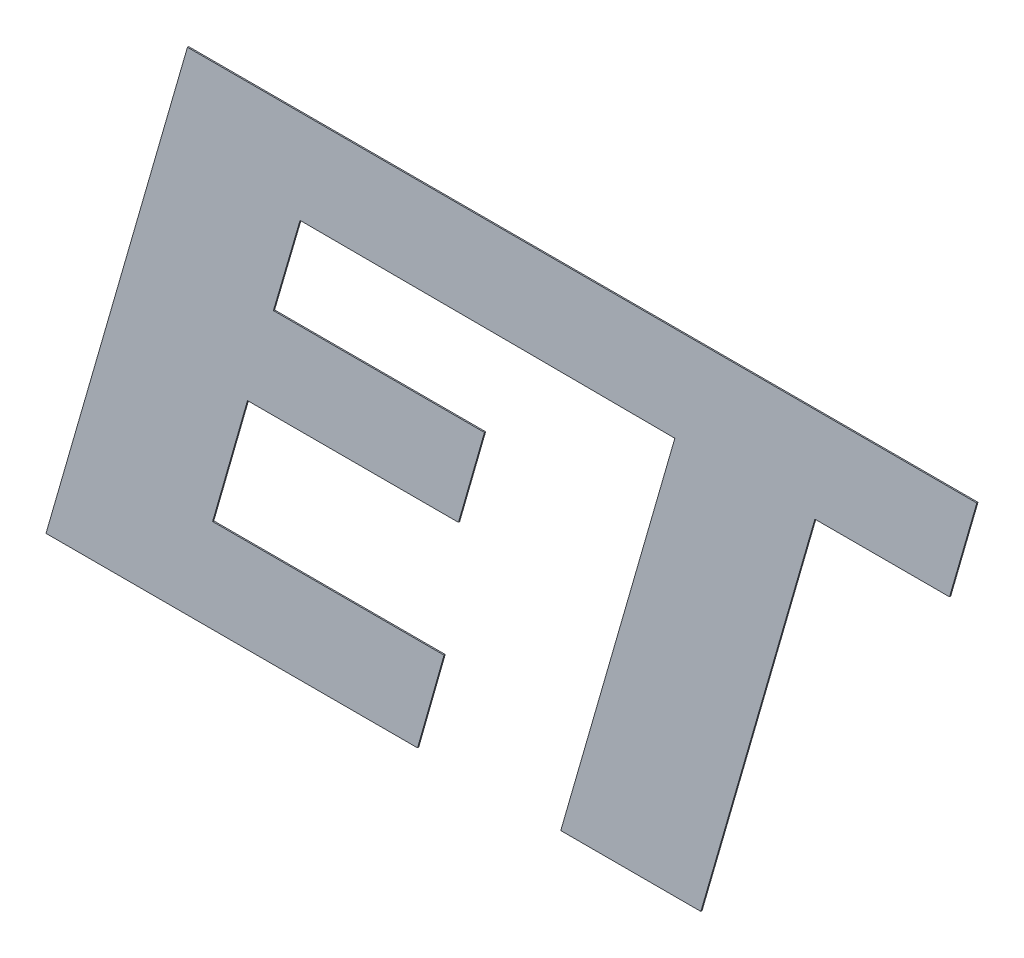
ISO-10303-21;
HEADER;
FILE_DESCRIPTION(('STEP AP214'),'2;1');
FILE_NAME('part.step','',(''),(''),'','','');
FILE_SCHEMA(('AUTOMOTIVE_DESIGN { 1 0 10303 214 1 1 1 1 }'));
ENDSEC;
DATA;
#1=APPLICATION_CONTEXT('core data for automotive mechanical design processes');
#2=APPLICATION_PROTOCOL_DEFINITION('international standard','automotive_design',2000,#1);
#3=PRODUCT_CONTEXT('',#1,'mechanical');
#4=PRODUCT('Part','Part','',(#3));
#5=PRODUCT_RELATED_PRODUCT_CATEGORY('part','',(#4));
#6=PRODUCT_DEFINITION_FORMATION('','',#4);
#7=PRODUCT_DEFINITION_CONTEXT('part definition',#1,'design');
#8=PRODUCT_DEFINITION('design','',#6,#7);
#9=PRODUCT_DEFINITION_SHAPE('','',#8);
#10=(LENGTH_UNIT() NAMED_UNIT(*) SI_UNIT(.MILLI.,.METRE.));
#11=(NAMED_UNIT(*) PLANE_ANGLE_UNIT() SI_UNIT($,.RADIAN.));
#12=(NAMED_UNIT(*) SI_UNIT($,.STERADIAN.) SOLID_ANGLE_UNIT());
#13=UNCERTAINTY_MEASURE_WITH_UNIT(LENGTH_MEASURE(1.E-05),#10,'distance_accuracy_value','');
#14=(GEOMETRIC_REPRESENTATION_CONTEXT(3) GLOBAL_UNCERTAINTY_ASSIGNED_CONTEXT((#13)) GLOBAL_UNIT_ASSIGNED_CONTEXT((#10,
#11,#12)) REPRESENTATION_CONTEXT('',''));
#15=CARTESIAN_POINT('',(0.,0.,0.));
#16=DIRECTION('',(0.,0.,1.));
#17=DIRECTION('',(1.,0.,0.));
#18=AXIS2_PLACEMENT_3D('',#15,#16,#17);
#19=CARTESIAN_POINT('',(11.563212908811,6.43585562533324,5.205));
#20=DIRECTION('',(0.00281330167602132,0.99999604265901,0.));
#21=DIRECTION('',(0.,0.,-1.));
#22=AXIS2_PLACEMENT_3D('',#19,#20,#21);
#23=PLANE('',#22);
#24=DIRECTION('',(0.99999604265901,-0.00281330167602132,0.));
#25=VECTOR('',#24,1.);
#26=CARTESIAN_POINT('',(11.563212908811,6.43585562533324,5.2));
#27=LINE('',#26,#25);
#28=CARTESIAN_POINT('',(11.563212908811,6.43585562533324,5.2));
#29=VERTEX_POINT('',#28);
#30=CARTESIAN_POINT('',(12.5025242320755,6.43321304875561,5.2));
#31=VERTEX_POINT('',#30);
#32=EDGE_CURVE('E10',#29,#31,#27,.T.);
#33=ORIENTED_EDGE('',*,*,#32,.T.);
#34=DIRECTION('',(0.,0.,-1.));
#35=VECTOR('',#34,1.);
#36=CARTESIAN_POINT('',(12.5025242320755,6.43321304875561,5.205));
#37=LINE('',#36,#35);
#38=CARTESIAN_POINT('',(12.5025242320755,6.43321304875561,5.205));
#39=VERTEX_POINT('',#38);
#40=EDGE_CURVE('E42',#39,#31,#37,.T.);
#41=ORIENTED_EDGE('',*,*,#40,.F.);
#42=DIRECTION('',(0.99999604265901,-0.00281330167602132,0.));
#43=VECTOR('',#42,1.);
#44=CARTESIAN_POINT('',(11.563212908811,6.43585562533324,5.205));
#45=LINE('',#44,#43);
#46=CARTESIAN_POINT('',(11.563212908811,6.43585562533324,5.205));
#47=VERTEX_POINT('',#46);
#48=EDGE_CURVE('E250',#47,#39,#45,.T.);
#49=ORIENTED_EDGE('',*,*,#48,.F.);
#50=DIRECTION('',(0.,0.,-1.));
#51=VECTOR('',#50,1.);
#52=CARTESIAN_POINT('',(11.563212908811,6.43585562533324,5.205));
#53=LINE('',#52,#51);
#54=EDGE_CURVE('E27',#47,#29,#53,.T.);
#55=ORIENTED_EDGE('',*,*,#54,.T.);
#56=EDGE_LOOP('',(#33,#41,#49,#55));
#57=FACE_BOUND('',#56,.T.);
#58=ADVANCED_FACE('F16',(#57),#23,.F.);
#59=CARTESIAN_POINT('',(12.5025242320755,6.43321304875561,5.205));
#60=DIRECTION('',(0.00465069382367867,0.999989185465002,0.));
#61=DIRECTION('',(0.,0.,-1.));
#62=AXIS2_PLACEMENT_3D('',#59,#60,#61);
#63=PLANE('',#62);
#64=DIRECTION('',(0.999989185465002,-0.00465069382367867,0.));
#65=VECTOR('',#64,1.);
#66=CARTESIAN_POINT('',(12.5025242320755,6.43321304875561,5.2));
#67=LINE('',#66,#65);
#68=CARTESIAN_POINT('',(13.1256737048785,6.43031494000952,5.2));
#69=VERTEX_POINT('',#68);
#70=EDGE_CURVE('E228',#31,#69,#67,.T.);
#71=ORIENTED_EDGE('',*,*,#70,.T.);
#72=DIRECTION('',(0.,0.,-1.));
#73=VECTOR('',#72,1.);
#74=CARTESIAN_POINT('',(13.1256737048785,6.43031494000952,5.205));
#75=LINE('',#74,#73);
#76=CARTESIAN_POINT('',(13.1256737048785,6.43031494000952,5.205));
#77=VERTEX_POINT('',#76);
#78=EDGE_CURVE('E419',#77,#69,#75,.T.);
#79=ORIENTED_EDGE('',*,*,#78,.F.);
#80=DIRECTION('',(0.999989185465002,-0.00465069382367867,0.));
#81=VECTOR('',#80,1.);
#82=CARTESIAN_POINT('',(12.5025242320755,6.43321304875561,5.205));
#83=LINE('',#82,#81);
#84=EDGE_CURVE('E220',#39,#77,#83,.T.);
#85=ORIENTED_EDGE('',*,*,#84,.F.);
#86=ORIENTED_EDGE('',*,*,#40,.T.);
#87=EDGE_LOOP('',(#71,#79,#85,#86));
#88=FACE_BOUND('',#87,.T.);
#89=ADVANCED_FACE('F453',(#88),#63,.F.);
#90=CARTESIAN_POINT('',(13.1256737048785,6.43031494000952,5.205));
#91=DIRECTION('',(0.961066454899901,-0.276317334356962,0.));
#92=DIRECTION('',(0.,0.,-1.));
#93=AXIS2_PLACEMENT_3D('',#90,#91,#92);
#94=PLANE('',#93);
#95=DIRECTION('',(-0.276317334356962,-0.961066454899901,0.));
#96=VECTOR('',#95,1.);
#97=CARTESIAN_POINT('',(13.1256737048785,6.43031494000952,5.2));
#98=LINE('',#97,#96);
#99=CARTESIAN_POINT('',(12.6501345708676,4.77632999999994,5.2));
#100=VERTEX_POINT('',#99);
#101=EDGE_CURVE('E247',#69,#100,#98,.T.);
#102=ORIENTED_EDGE('',*,*,#101,.T.);
#103=DIRECTION('',(0.,0.,-1.));
#104=VECTOR('',#103,1.);
#105=CARTESIAN_POINT('',(12.6501345708676,4.77632999999994,5.205));
#106=LINE('',#105,#104);
#107=CARTESIAN_POINT('',(12.6501345708676,4.77632999999994,5.205));
#108=VERTEX_POINT('',#107);
#109=EDGE_CURVE('E235',#108,#100,#106,.T.);
#110=ORIENTED_EDGE('',*,*,#109,.F.);
#111=DIRECTION('',(-0.276317334356962,-0.961066454899901,0.));
#112=VECTOR('',#111,1.);
#113=CARTESIAN_POINT('',(13.1256737048785,6.43031494000952,5.205));
#114=LINE('',#113,#112);
#115=EDGE_CURVE('E218',#77,#108,#114,.T.);
#116=ORIENTED_EDGE('',*,*,#115,.F.);
#117=ORIENTED_EDGE('',*,*,#78,.T.);
#118=EDGE_LOOP('',(#102,#110,#116,#117));
#119=FACE_BOUND('',#118,.T.);
#120=ADVANCED_FACE('F458',(#119),#94,.F.);
#121=CARTESIAN_POINT('',(12.6501345708676,4.77632999999994,5.205));
#122=DIRECTION('',(0.,1.,0.));
#123=DIRECTION('',(1.,0.,0.));
#124=AXIS2_PLACEMENT_3D('',#121,#122,#123);
#125=PLANE('',#124);
#126=DIRECTION('',(1.,0.,0.));
#127=VECTOR('',#126,1.);
#128=CARTESIAN_POINT('',(12.6501345708676,4.77632999999994,5.2));
#129=LINE('',#128,#127);
#130=CARTESIAN_POINT('',(13.2340318095169,4.77632999999994,5.2));
#131=VERTEX_POINT('',#130);
#132=EDGE_CURVE('E174',#100,#131,#129,.T.);
#133=ORIENTED_EDGE('',*,*,#132,.T.);
#134=DIRECTION('',(0.,0.,-1.));
#135=VECTOR('',#134,1.);
#136=CARTESIAN_POINT('',(13.2340318095169,4.77632999999994,5.205));
#137=LINE('',#136,#135);
#138=CARTESIAN_POINT('',(13.2340318095169,4.77632999999994,5.205));
#139=VERTEX_POINT('',#138);
#140=EDGE_CURVE('E208',#139,#131,#137,.T.);
#141=ORIENTED_EDGE('',*,*,#140,.F.);
#142=DIRECTION('',(1.,0.,0.));
#143=VECTOR('',#142,1.);
#144=CARTESIAN_POINT('',(12.6501345708676,4.77632999999994,5.205));
#145=LINE('',#144,#143);
#146=EDGE_CURVE('E144',#108,#139,#145,.T.);
#147=ORIENTED_EDGE('',*,*,#146,.F.);
#148=ORIENTED_EDGE('',*,*,#109,.T.);
#149=EDGE_LOOP('',(#133,#141,#147,#148));
#150=FACE_BOUND('',#149,.T.);
#151=ADVANCED_FACE('F436',(#150),#125,.F.);
#152=CARTESIAN_POINT('',(13.2340318095169,4.77632999999994,5.205));
#153=DIRECTION('',(-0.961087610217285,0.276243742891722,0.));
#154=DIRECTION('',(0.,0.,1.));
#155=AXIS2_PLACEMENT_3D('',#152,#153,#154);
#156=PLANE('',#155);
#157=DIRECTION('',(0.276243742891722,0.961087610217285,0.));
#158=VECTOR('',#157,1.);
#159=CARTESIAN_POINT('',(13.2340318095169,4.77632999999994,5.2));
#160=LINE('',#159,#158);
#161=CARTESIAN_POINT('',(13.7094338287044,6.43031494000443,5.2));
#162=VERTEX_POINT('',#161);
#163=EDGE_CURVE('E153',#131,#162,#160,.T.);
#164=ORIENTED_EDGE('',*,*,#163,.T.);
#165=DIRECTION('',(0.,0.,-1.));
#166=VECTOR('',#165,1.);
#167=CARTESIAN_POINT('',(13.7094338287044,6.43031494000443,5.205));
#168=LINE('',#167,#166);
#169=CARTESIAN_POINT('',(13.7094338287044,6.43031494000443,5.205));
#170=VERTEX_POINT('',#169);
#171=EDGE_CURVE('E150',#170,#162,#168,.T.);
#172=ORIENTED_EDGE('',*,*,#171,.F.);
#173=DIRECTION('',(0.276243742891722,0.961087610217285,0.));
#174=VECTOR('',#173,1.);
#175=CARTESIAN_POINT('',(13.2340318095169,4.77632999999994,5.205));
#176=LINE('',#175,#174);
#177=EDGE_CURVE('E137',#139,#170,#176,.T.);
#178=ORIENTED_EDGE('',*,*,#177,.F.);
#179=ORIENTED_EDGE('',*,*,#140,.T.);
#180=EDGE_LOOP('',(#164,#172,#178,#179));
#181=FACE_BOUND('',#180,.T.);
#182=ADVANCED_FACE('F151',(#181),#156,.F.);
#183=CARTESIAN_POINT('',(13.7094338287044,6.43031494000443,5.205));
#184=DIRECTION('',(7.938847109814E-05,0.999999996848735,0.));
#185=DIRECTION('',(0.,0.,-1.));
#186=AXIS2_PLACEMENT_3D('',#183,#184,#185);
#187=PLANE('',#186);
#188=DIRECTION('',(0.999999996848735,-7.93884710981399E-05,0.));
#189=VECTOR('',#188,1.);
#190=CARTESIAN_POINT('',(13.7094338287044,6.43031494000443,5.2));
#191=LINE('',#190,#189);
#192=CARTESIAN_POINT('',(14.2706376699915,6.43027038688935,5.2));
#193=VERTEX_POINT('',#192);
#194=EDGE_CURVE('E158',#162,#193,#191,.T.);
#195=ORIENTED_EDGE('',*,*,#194,.T.);
#196=DIRECTION('',(0.,0.,-1.));
#197=VECTOR('',#196,1.);
#198=CARTESIAN_POINT('',(14.2706376699915,6.43027038688935,5.205));
#199=LINE('',#198,#197);
#200=CARTESIAN_POINT('',(14.2706376699915,6.43027038688935,5.205));
#201=VERTEX_POINT('',#200);
#202=EDGE_CURVE('E162',#201,#193,#199,.T.);
#203=ORIENTED_EDGE('',*,*,#202,.F.);
#204=DIRECTION('',(0.999999996848735,-7.93884710981399E-05,0.));
#205=VECTOR('',#204,1.);
#206=CARTESIAN_POINT('',(13.7094338287044,6.43031494000443,5.205));
#207=LINE('',#206,#205);
#208=EDGE_CURVE('E141',#170,#201,#207,.T.);
#209=ORIENTED_EDGE('',*,*,#208,.F.);
#210=ORIENTED_EDGE('',*,*,#171,.T.);
#211=EDGE_LOOP('',(#195,#203,#209,#210));
#212=FACE_BOUND('',#211,.T.);
#213=ADVANCED_FACE('F161',(#212),#187,.F.);
#214=CARTESIAN_POINT('',(14.2706376699915,6.43027038688935,5.205));
#215=DIRECTION('',(-0.961099233430489,0.276203301029018,0.));
#216=DIRECTION('',(0.,0.,1.));
#217=AXIS2_PLACEMENT_3D('',#214,#215,#216);
#218=PLANE('',#217);
#219=DIRECTION('',(0.276203301029018,0.961099233430489,0.));
#220=VECTOR('',#219,1.);
#221=CARTESIAN_POINT('',(14.2706376699915,6.43027038688935,5.2));
#222=LINE('',#221,#220);
#223=CARTESIAN_POINT('',(14.3843877760506,6.82608440985244,5.2));
#224=VERTEX_POINT('',#223);
#225=EDGE_CURVE('E159',#193,#224,#222,.T.);
#226=ORIENTED_EDGE('',*,*,#225,.T.);
#227=DIRECTION('',(0.,0.,-1.));
#228=VECTOR('',#227,1.);
#229=CARTESIAN_POINT('',(14.3843877760506,6.82608440985244,5.205));
#230=LINE('',#229,#228);
#231=CARTESIAN_POINT('',(14.3843877760506,6.82608440985244,5.205));
#232=VERTEX_POINT('',#231);
#233=EDGE_CURVE('E186',#232,#224,#230,.T.);
#234=ORIENTED_EDGE('',*,*,#233,.F.);
#235=DIRECTION('',(0.276203301029018,0.961099233430489,0.));
#236=VECTOR('',#235,1.);
#237=CARTESIAN_POINT('',(14.2706376699915,6.43027038688935,5.205));
#238=LINE('',#237,#236);
#239=EDGE_CURVE('E165',#201,#232,#238,.T.);
#240=ORIENTED_EDGE('',*,*,#239,.F.);
#241=ORIENTED_EDGE('',*,*,#202,.T.);
#242=EDGE_LOOP('',(#226,#234,#240,#241));
#243=FACE_BOUND('',#242,.T.);
#244=ADVANCED_FACE('F441',(#243),#218,.F.);
#245=CARTESIAN_POINT('',(12.6155317773363,6.82608440985244,5.205));
#246=DIRECTION('',(0.,-1.,0.));
#247=DIRECTION('',(0.,0.,-1.));
#248=AXIS2_PLACEMENT_3D('',#245,#246,#247);
#249=PLANE('',#248);
#250=DIRECTION('',(-1.,0.,0.));
#251=VECTOR('',#250,1.);
#252=CARTESIAN_POINT('',(12.6155317773363,6.82608440985244,5.2));
#253=LINE('',#252,#251);
#254=CARTESIAN_POINT('',(11.0938813384048,6.82608440985244,5.2));
#255=VERTEX_POINT('',#254);
#256=EDGE_CURVE('E270',#224,#255,#253,.T.);
#257=ORIENTED_EDGE('',*,*,#256,.T.);
#258=DIRECTION('',(0.,0.,-1.));
#259=VECTOR('',#258,1.);
#260=CARTESIAN_POINT('',(11.0938813384048,6.82608440985244,5.205));
#261=LINE('',#260,#259);
#262=CARTESIAN_POINT('',(11.0938813384048,6.82608440985244,5.205));
#263=VERTEX_POINT('',#262);
#264=EDGE_CURVE('E187',#263,#255,#261,.T.);
#265=ORIENTED_EDGE('',*,*,#264,.F.);
#266=DIRECTION('',(-1.,0.,0.));
#267=VECTOR('',#266,1.);
#268=CARTESIAN_POINT('',(14.3843877760506,6.82608440985244,5.205));
#269=LINE('',#268,#267);
#270=EDGE_CURVE('E171',#232,#263,#269,.T.);
#271=ORIENTED_EDGE('',*,*,#270,.F.);
#272=ORIENTED_EDGE('',*,*,#233,.T.);
#273=EDGE_LOOP('',(#257,#265,#271,#272));
#274=FACE_BOUND('',#273,.T.);
#275=ADVANCED_FACE('F383',(#274),#249,.F.);
#276=CARTESIAN_POINT('',(11.0938813384048,6.82608440985244,5.205));
#277=DIRECTION('',(0.961034823670664,-0.276427328048977,0.));
#278=DIRECTION('',(0.,0.,-1.));
#279=AXIS2_PLACEMENT_3D('',#276,#277,#278);
#280=PLANE('',#279);
#281=DIRECTION('',(-0.276427328048977,-0.961034823670664,0.));
#282=VECTOR('',#281,1.);
#283=CARTESIAN_POINT('',(11.0938813384048,6.82608440985244,5.2));
#284=LINE('',#283,#282);
#285=CARTESIAN_POINT('',(10.5043000654724,4.77632999999994,5.2));
#286=VERTEX_POINT('',#285);
#287=EDGE_CURVE('E182',#255,#286,#284,.T.);
#288=ORIENTED_EDGE('',*,*,#287,.T.);
#289=DIRECTION('',(0.,0.,-1.));
#290=VECTOR('',#289,1.);
#291=CARTESIAN_POINT('',(10.5043000654724,4.77632999999994,5.205));
#292=LINE('',#291,#290);
#293=CARTESIAN_POINT('',(10.5043000654724,4.77632999999994,5.205));
#294=VERTEX_POINT('',#293);
#295=EDGE_CURVE('E258',#294,#286,#292,.T.);
#296=ORIENTED_EDGE('',*,*,#295,.F.);
#297=DIRECTION('',(-0.276427328048977,-0.961034823670664,0.));
#298=VECTOR('',#297,1.);
#299=CARTESIAN_POINT('',(11.0938813384048,6.82608440985244,5.205));
#300=LINE('',#299,#298);
#301=EDGE_CURVE('E194',#263,#294,#300,.T.);
#302=ORIENTED_EDGE('',*,*,#301,.F.);
#303=ORIENTED_EDGE('',*,*,#264,.T.);
#304=EDGE_LOOP('',(#288,#296,#302,#303));
#305=FACE_BOUND('',#304,.T.);
#306=ADVANCED_FACE('F386',(#305),#280,.F.);
#307=CARTESIAN_POINT('',(10.5043000654724,4.77632999999994,5.205));
#308=DIRECTION('',(0.,1.,0.));
#309=DIRECTION('',(1.,0.,0.));
#310=AXIS2_PLACEMENT_3D('',#307,#308,#309);
#311=PLANE('',#310);
#312=DIRECTION('',(1.,0.,0.));
#313=VECTOR('',#312,1.);
#314=CARTESIAN_POINT('',(10.5043000654724,4.77632999999994,5.2));
#315=LINE('',#314,#313);
#316=CARTESIAN_POINT('',(12.0529496594305,4.77632999999994,5.2));
#317=VERTEX_POINT('',#316);
#318=EDGE_CURVE('E254',#286,#317,#315,.T.);
#319=ORIENTED_EDGE('',*,*,#318,.T.);
#320=DIRECTION('',(0.,0.,-1.));
#321=VECTOR('',#320,1.);
#322=CARTESIAN_POINT('',(12.0529496594305,4.77632999999994,5.205));
#323=LINE('',#322,#321);
#324=CARTESIAN_POINT('',(12.0529496594305,4.77632999999994,5.205));
#325=VERTEX_POINT('',#324);
#326=EDGE_CURVE('E180',#325,#317,#323,.T.);
#327=ORIENTED_EDGE('',*,*,#326,.F.);
#328=DIRECTION('',(1.,0.,0.));
#329=VECTOR('',#328,1.);
#330=CARTESIAN_POINT('',(10.5043000654724,4.77632999999994,5.205));
#331=LINE('',#330,#329);
#332=EDGE_CURVE('E197',#294,#325,#331,.T.);
#333=ORIENTED_EDGE('',*,*,#332,.F.);
#334=ORIENTED_EDGE('',*,*,#295,.T.);
#335=EDGE_LOOP('',(#319,#327,#333,#334));
#336=FACE_BOUND('',#335,.T.);
#337=ADVANCED_FACE('F391',(#336),#311,.F.);
#338=CARTESIAN_POINT('',(12.0529496594305,4.77632999999994,5.205));
#339=DIRECTION('',(-0.962020079379883,0.272978693069485,0.));
#340=DIRECTION('',(0.,0.,1.));
#341=AXIS2_PLACEMENT_3D('',#338,#339,#340);
#342=PLANE('',#341);
#343=DIRECTION('',(0.272978693069485,0.962020079379883,0.));
#344=VECTOR('',#343,1.);
#345=CARTESIAN_POINT('',(12.0529496594305,4.77632999999994,5.2));
#346=LINE('',#345,#344);
#347=CARTESIAN_POINT('',(12.1636262510655,5.16637180975795,5.2));
#348=VERTEX_POINT('',#347);
#349=EDGE_CURVE('E262',#317,#348,#346,.T.);
#350=ORIENTED_EDGE('',*,*,#349,.T.);
#351=DIRECTION('',(0.,0.,-1.));
#352=VECTOR('',#351,1.);
#353=CARTESIAN_POINT('',(12.1636262510655,5.16637180975795,5.205));
#354=LINE('',#353,#352);
#355=CARTESIAN_POINT('',(12.1636262510655,5.16637180975795,5.205));
#356=VERTEX_POINT('',#355);
#357=EDGE_CURVE('E181',#356,#348,#354,.T.);
#358=ORIENTED_EDGE('',*,*,#357,.F.);
#359=DIRECTION('',(0.272978693069485,0.962020079379883,0.));
#360=VECTOR('',#359,1.);
#361=CARTESIAN_POINT('',(12.0529496594305,4.77632999999994,5.205));
#362=LINE('',#361,#360);
#363=EDGE_CURVE('E20',#325,#356,#362,.T.);
#364=ORIENTED_EDGE('',*,*,#363,.F.);
#365=ORIENTED_EDGE('',*,*,#326,.T.);
#366=EDGE_LOOP('',(#350,#358,#364,#365));
#367=FACE_BOUND('',#366,.T.);
#368=ADVANCED_FACE('F399',(#367),#342,.F.);
#369=CARTESIAN_POINT('',(12.1636262510655,5.16637180975795,5.205));
#370=DIRECTION('',(0.,-1.,0.));
#371=DIRECTION('',(0.,0.,-1.));
#372=AXIS2_PLACEMENT_3D('',#369,#370,#371);
#373=PLANE('',#372);
#374=DIRECTION('',(-1.,0.,0.));
#375=VECTOR('',#374,1.);
#376=CARTESIAN_POINT('',(12.1636262510655,5.16637180975795,5.2));
#377=LINE('',#376,#375);
#378=CARTESIAN_POINT('',(11.1987492459184,5.16637180975795,5.2));
#379=VERTEX_POINT('',#378);
#380=EDGE_CURVE('E176',#348,#379,#377,.T.);
#381=ORIENTED_EDGE('',*,*,#380,.T.);
#382=DIRECTION('',(0.,0.,-1.));
#383=VECTOR('',#382,1.);
#384=CARTESIAN_POINT('',(11.1987492459184,5.16637180975795,5.205));
#385=LINE('',#384,#383);
#386=CARTESIAN_POINT('',(11.1987492459184,5.16637180975795,5.205));
#387=VERTEX_POINT('',#386);
#388=EDGE_CURVE('E198',#387,#379,#385,.T.);
#389=ORIENTED_EDGE('',*,*,#388,.F.);
#390=DIRECTION('',(-1.,0.,0.));
#391=VECTOR('',#390,1.);
#392=CARTESIAN_POINT('',(12.1636262510655,5.16637180975795,5.205));
#393=LINE('',#392,#391);
#394=EDGE_CURVE('E300',#356,#387,#393,.T.);
#395=ORIENTED_EDGE('',*,*,#394,.F.);
#396=ORIENTED_EDGE('',*,*,#357,.T.);
#397=EDGE_LOOP('',(#381,#389,#395,#396));
#398=FACE_BOUND('',#397,.T.);
#399=ADVANCED_FACE('F403',(#398),#373,.F.);
#400=CARTESIAN_POINT('',(11.1987492459184,5.16637180975795,5.205));
#401=DIRECTION('',(-0.961582531986915,0.274515999857263,0.));
#402=DIRECTION('',(0.,0.,1.));
#403=AXIS2_PLACEMENT_3D('',#400,#401,#402);
#404=PLANE('',#403);
#405=DIRECTION('',(0.274515999857263,0.961582531986915,0.));
#406=VECTOR('',#405,1.);
#407=CARTESIAN_POINT('',(11.1987492459184,5.16637180975795,5.2));
#408=LINE('',#407,#406);
#409=CARTESIAN_POINT('',(11.3441657475534,5.67574090994719,5.2));
#410=VERTEX_POINT('',#409);
#411=EDGE_CURVE('E201',#379,#410,#408,.T.);
#412=ORIENTED_EDGE('',*,*,#411,.T.);
#413=DIRECTION('',(0.,0.,-1.));
#414=VECTOR('',#413,1.);
#415=CARTESIAN_POINT('',(11.3441657475534,5.67574090994719,5.205));
#416=LINE('',#415,#414);
#417=CARTESIAN_POINT('',(11.3441657475534,5.67574090994719,5.205));
#418=VERTEX_POINT('',#417);
#419=EDGE_CURVE('E234',#418,#410,#416,.T.);
#420=ORIENTED_EDGE('',*,*,#419,.F.);
#421=DIRECTION('',(0.274515999857263,0.961582531986915,0.));
#422=VECTOR('',#421,1.);
#423=CARTESIAN_POINT('',(11.1987492459184,5.16637180975795,5.205));
#424=LINE('',#423,#422);
#425=EDGE_CURVE('E192',#387,#418,#424,.T.);
#426=ORIENTED_EDGE('',*,*,#425,.F.);
#427=ORIENTED_EDGE('',*,*,#388,.T.);
#428=EDGE_LOOP('',(#412,#420,#426,#427));
#429=FACE_BOUND('',#428,.T.);
#430=ADVANCED_FACE('F481',(#429),#404,.F.);
#431=CARTESIAN_POINT('',(11.3441657475534,5.67574090994719,5.205));
#432=DIRECTION('',(0.,1.,0.));
#433=DIRECTION('',(1.,0.,0.));
#434=AXIS2_PLACEMENT_3D('',#431,#432,#433);
#435=PLANE('',#434);
#436=DIRECTION('',(1.,0.,0.));
#437=VECTOR('',#436,1.);
#438=CARTESIAN_POINT('',(11.3441657475534,5.67574090994719,5.2));
#439=LINE('',#438,#437);
#440=CARTESIAN_POINT('',(12.2236825432721,5.67574090994719,5.2));
#441=VERTEX_POINT('',#440);
#442=EDGE_CURVE('E202',#410,#441,#439,.T.);
#443=ORIENTED_EDGE('',*,*,#442,.T.);
#444=DIRECTION('',(0.,0.,-1.));
#445=VECTOR('',#444,1.);
#446=CARTESIAN_POINT('',(12.2236825432721,5.67574090994719,5.205));
#447=LINE('',#446,#445);
#448=CARTESIAN_POINT('',(12.2236825432721,5.67574090994719,5.205));
#449=VERTEX_POINT('',#448);
#450=EDGE_CURVE('E203',#449,#441,#447,.T.);
#451=ORIENTED_EDGE('',*,*,#450,.F.);
#452=DIRECTION('',(1.,0.,0.));
#453=VECTOR('',#452,1.);
#454=CARTESIAN_POINT('',(11.3441657475534,5.67574090994719,5.205));
#455=LINE('',#454,#453);
#456=EDGE_CURVE('E188',#418,#449,#455,.T.);
#457=ORIENTED_EDGE('',*,*,#456,.F.);
#458=ORIENTED_EDGE('',*,*,#419,.T.);
#459=EDGE_LOOP('',(#443,#451,#457,#458));
#460=FACE_BOUND('',#459,.T.);
#461=ADVANCED_FACE('F479',(#460),#435,.F.);
#462=CARTESIAN_POINT('',(12.2236825432721,5.67574090994719,5.205));
#463=DIRECTION('',(-0.961532303768429,0.274691879766727,0.));
#464=DIRECTION('',(0.,0.,1.));
#465=AXIS2_PLACEMENT_3D('',#462,#463,#464);
#466=PLANE('',#465);
#467=DIRECTION('',(0.274691879766727,0.961532303768429,0.));
#468=VECTOR('',#467,1.);
#469=CARTESIAN_POINT('',(12.2236825432721,5.67574090994719,5.2));
#470=LINE('',#469,#468);
#471=CARTESIAN_POINT('',(12.3319159980721,6.05460162919037,5.2));
#472=VERTEX_POINT('',#471);
#473=EDGE_CURVE('E206',#441,#472,#470,.T.);
#474=ORIENTED_EDGE('',*,*,#473,.T.);
#475=DIRECTION('',(0.,0.,-1.));
#476=VECTOR('',#475,1.);
#477=CARTESIAN_POINT('',(12.3319159980721,6.05460162919037,5.205));
#478=LINE('',#477,#476);
#479=CARTESIAN_POINT('',(12.3319159980721,6.05460162919037,5.205));
#480=VERTEX_POINT('',#479);
#481=EDGE_CURVE('E243',#480,#472,#478,.T.);
#482=ORIENTED_EDGE('',*,*,#481,.F.);
#483=DIRECTION('',(0.274691879766727,0.961532303768429,0.));
#484=VECTOR('',#483,1.);
#485=CARTESIAN_POINT('',(12.2236825432721,5.67574090994719,5.205));
#486=LINE('',#485,#484);
#487=EDGE_CURVE('E193',#449,#480,#486,.T.);
#488=ORIENTED_EDGE('',*,*,#487,.F.);
#489=ORIENTED_EDGE('',*,*,#450,.T.);
#490=EDGE_LOOP('',(#474,#482,#488,#489));
#491=FACE_BOUND('',#490,.T.);
#492=ADVANCED_FACE('F340',(#491),#466,.F.);
#493=CARTESIAN_POINT('',(12.3319159980721,6.05460162919037,5.205));
#494=DIRECTION('',(0.,-1.,0.));
#495=DIRECTION('',(0.,0.,-1.));
#496=AXIS2_PLACEMENT_3D('',#493,#494,#495);
#497=PLANE('',#496);
#498=DIRECTION('',(-1.,0.,0.));
#499=VECTOR('',#498,1.);
#500=CARTESIAN_POINT('',(12.3319159980721,6.05460162919037,5.2));
#501=LINE('',#500,#499);
#502=CARTESIAN_POINT('',(11.4522745525148,6.05460162919037,5.2));
#503=VERTEX_POINT('',#502);
#504=EDGE_CURVE('E207',#472,#503,#501,.T.);
#505=ORIENTED_EDGE('',*,*,#504,.T.);
#506=DIRECTION('',(0.,0.,-1.));
#507=VECTOR('',#506,1.);
#508=CARTESIAN_POINT('',(11.4522745525148,6.05460162919037,5.205));
#509=LINE('',#508,#507);
#510=CARTESIAN_POINT('',(11.4522745525148,6.05460162919037,5.205));
#511=VERTEX_POINT('',#510);
#512=EDGE_CURVE('E244',#511,#503,#509,.T.);
#513=ORIENTED_EDGE('',*,*,#512,.F.);
#514=DIRECTION('',(-1.,0.,0.));
#515=VECTOR('',#514,1.);
#516=CARTESIAN_POINT('',(12.3319159980721,6.05460162919037,5.205));
#517=LINE('',#516,#515);
#518=EDGE_CURVE('E308',#480,#511,#517,.T.);
#519=ORIENTED_EDGE('',*,*,#518,.F.);
#520=ORIENTED_EDGE('',*,*,#481,.T.);
#521=EDGE_LOOP('',(#505,#513,#519,#520));
#522=FACE_BOUND('',#521,.T.);
#523=ADVANCED_FACE('F334',(#522),#497,.F.);
#524=CARTESIAN_POINT('',(11.4522745525148,6.05460162919037,5.205));
#525=DIRECTION('',(-0.960176311434603,0.279394794081492,0.));
#526=DIRECTION('',(0.,0.,1.));
#527=AXIS2_PLACEMENT_3D('',#524,#525,#526);
#528=PLANE('',#527);
#529=DIRECTION('',(0.279394794081492,0.960176311434603,0.));
#530=VECTOR('',#529,1.);
#531=CARTESIAN_POINT('',(11.4522745525148,6.05460162919037,5.2));
#532=LINE('',#531,#530);
#533=EDGE_CURVE('E239',#503,#29,#532,.T.);
#534=ORIENTED_EDGE('',*,*,#533,.T.);
#535=ORIENTED_EDGE('',*,*,#54,.F.);
#536=DIRECTION('',(0.279394794081492,0.960176311434603,0.));
#537=VECTOR('',#536,1.);
#538=CARTESIAN_POINT('',(11.4522745525148,6.05460162919037,5.205));
#539=LINE('',#538,#537);
#540=EDGE_CURVE('E314',#511,#47,#539,.T.);
#541=ORIENTED_EDGE('',*,*,#540,.F.);
#542=ORIENTED_EDGE('',*,*,#512,.T.);
#543=EDGE_LOOP('',(#534,#535,#541,#542));
#544=FACE_BOUND('',#543,.T.);
#545=ADVANCED_FACE('F349',(#544),#528,.F.);
#546=CARTESIAN_POINT('',(-0.222484440430861,-1.85805867567166,5.205));
#547=DIRECTION('',(0.,0.,1.));
#548=DIRECTION('',(1.,0.,0.));
#549=AXIS2_PLACEMENT_3D('',#546,#547,#548);
#550=PLANE('',#549);
#551=ORIENTED_EDGE('',*,*,#48,.T.);
#552=ORIENTED_EDGE('',*,*,#84,.T.);
#553=ORIENTED_EDGE('',*,*,#115,.T.);
#554=ORIENTED_EDGE('',*,*,#146,.T.);
#555=ORIENTED_EDGE('',*,*,#177,.T.);
#556=ORIENTED_EDGE('',*,*,#208,.T.);
#557=ORIENTED_EDGE('',*,*,#239,.T.);
#558=ORIENTED_EDGE('',*,*,#270,.T.);
#559=ORIENTED_EDGE('',*,*,#301,.T.);
#560=ORIENTED_EDGE('',*,*,#332,.T.);
#561=ORIENTED_EDGE('',*,*,#363,.T.);
#562=ORIENTED_EDGE('',*,*,#394,.T.);
#563=ORIENTED_EDGE('',*,*,#425,.T.);
#564=ORIENTED_EDGE('',*,*,#456,.T.);
#565=ORIENTED_EDGE('',*,*,#487,.T.);
#566=ORIENTED_EDGE('',*,*,#518,.T.);
#567=ORIENTED_EDGE('',*,*,#540,.T.);
#568=EDGE_LOOP('',(#551,#552,#553,#554,#555,#556,#557,#558,#559,#560,#561,#562,#563,#564,#565,
#566,#567));
#569=FACE_BOUND('',#568,.T.);
#570=ADVANCED_FACE('F139',(#569),#550,.T.);
#571=CARTESIAN_POINT('',(-0.222484440430861,-1.85805867567166,5.2));
#572=DIRECTION('',(0.,0.,1.));
#573=DIRECTION('',(1.,0.,0.));
#574=AXIS2_PLACEMENT_3D('',#571,#572,#573);
#575=PLANE('',#574);
#576=ORIENTED_EDGE('',*,*,#32,.F.);
#577=ORIENTED_EDGE('',*,*,#533,.F.);
#578=ORIENTED_EDGE('',*,*,#504,.F.);
#579=ORIENTED_EDGE('',*,*,#473,.F.);
#580=ORIENTED_EDGE('',*,*,#442,.F.);
#581=ORIENTED_EDGE('',*,*,#411,.F.);
#582=ORIENTED_EDGE('',*,*,#380,.F.);
#583=ORIENTED_EDGE('',*,*,#349,.F.);
#584=ORIENTED_EDGE('',*,*,#318,.F.);
#585=ORIENTED_EDGE('',*,*,#287,.F.);
#586=ORIENTED_EDGE('',*,*,#256,.F.);
#587=ORIENTED_EDGE('',*,*,#225,.F.);
#588=ORIENTED_EDGE('',*,*,#194,.F.);
#589=ORIENTED_EDGE('',*,*,#163,.F.);
#590=ORIENTED_EDGE('',*,*,#132,.F.);
#591=ORIENTED_EDGE('',*,*,#101,.F.);
#592=ORIENTED_EDGE('',*,*,#70,.F.);
#593=EDGE_LOOP('',(#576,#577,#578,#579,#580,#581,#582,#583,#584,#585,#586,#587,#588,#589,#590,
#591,#592));
#594=FACE_BOUND('',#593,.T.);
#595=ADVANCED_FACE('F18',(#594),#575,.F.);
#596=CLOSED_SHELL('',(#58,#89,#120,#151,#182,#213,#244,#275,#306,#337,#368,#399,#430,#461,#492,
#523,#545,#570,#595));
#597=MANIFOLD_SOLID_BREP('B1',#596);
#598=ADVANCED_BREP_SHAPE_REPRESENTATION('',(#18,#597),#14);
#599=SHAPE_DEFINITION_REPRESENTATION(#9,#598);
ENDSEC;
END-ISO-10303-21;
